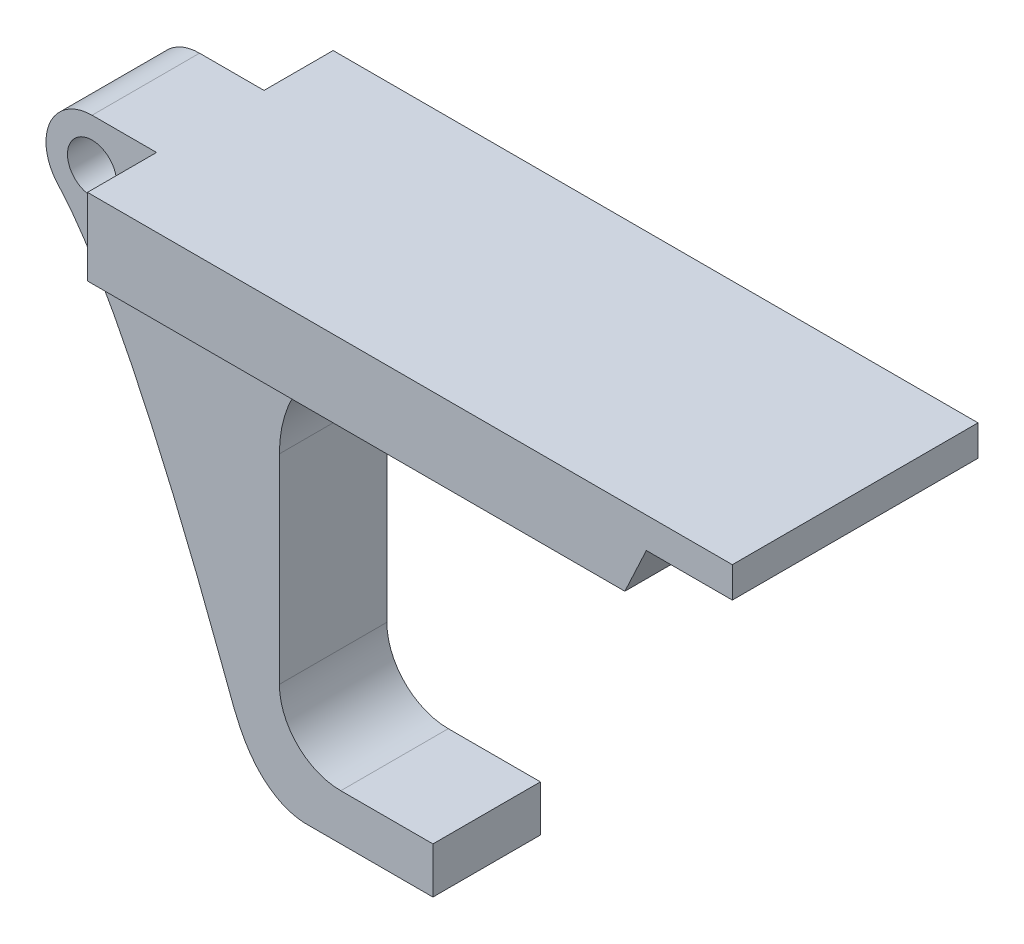
ISO-10303-21;
HEADER;
FILE_DESCRIPTION(('STEP AP214'),'2;1');
FILE_NAME('part.step','',(''),(''),'','','');
FILE_SCHEMA(('AUTOMOTIVE_DESIGN { 1 0 10303 214 1 1 1 1 }'));
ENDSEC;
DATA;
#1=APPLICATION_CONTEXT('core data for automotive mechanical design processes');
#2=APPLICATION_PROTOCOL_DEFINITION('international standard','automotive_design',2000,#1);
#3=PRODUCT_CONTEXT('',#1,'mechanical');
#4=PRODUCT('Part','Part','',(#3));
#5=PRODUCT_RELATED_PRODUCT_CATEGORY('part','',(#4));
#6=PRODUCT_DEFINITION_FORMATION('','',#4);
#7=PRODUCT_DEFINITION_CONTEXT('part definition',#1,'design');
#8=PRODUCT_DEFINITION('design','',#6,#7);
#9=PRODUCT_DEFINITION_SHAPE('','',#8);
#10=(LENGTH_UNIT() NAMED_UNIT(*) SI_UNIT(.MILLI.,.METRE.));
#11=(NAMED_UNIT(*) PLANE_ANGLE_UNIT() SI_UNIT($,.RADIAN.));
#12=(NAMED_UNIT(*) SI_UNIT($,.STERADIAN.) SOLID_ANGLE_UNIT());
#13=UNCERTAINTY_MEASURE_WITH_UNIT(LENGTH_MEASURE(1.E-05),#10,'distance_accuracy_value','');
#14=(GEOMETRIC_REPRESENTATION_CONTEXT(3) GLOBAL_UNCERTAINTY_ASSIGNED_CONTEXT((#13)) GLOBAL_UNIT_ASSIGNED_CONTEXT((#10,
#11,#12)) REPRESENTATION_CONTEXT('',''));
#15=CARTESIAN_POINT('',(0.,0.,0.));
#16=DIRECTION('',(0.,0.,1.));
#17=DIRECTION('',(1.,0.,0.));
#18=AXIS2_PLACEMENT_3D('',#15,#16,#17);
#19=CARTESIAN_POINT('',(21.,5.,8.));
#20=DIRECTION('',(-1.,0.,0.));
#21=DIRECTION('',(0.,0.,1.));
#22=AXIS2_PLACEMENT_3D('',#19,#20,#21);
#23=PLANE('',#22);
#24=DIRECTION('',(0.,0.,1.));
#25=VECTOR('',#24,1.);
#26=CARTESIAN_POINT('',(21.,3.,8.));
#27=LINE('',#26,#25);
#28=CARTESIAN_POINT('',(21.,3.,-8.));
#29=VERTEX_POINT('',#28);
#30=CARTESIAN_POINT('',(21.,3.,8.));
#31=VERTEX_POINT('',#30);
#32=EDGE_CURVE('E183',#29,#31,#27,.T.);
#33=ORIENTED_EDGE('',*,*,#32,.F.);
#34=DIRECTION('',(0.,-1.,0.));
#35=VECTOR('',#34,1.);
#36=CARTESIAN_POINT('',(21.,5.,-8.));
#37=LINE('',#36,#35);
#38=CARTESIAN_POINT('',(21.,5.,-8.));
#39=VERTEX_POINT('',#38);
#40=EDGE_CURVE('E195',#39,#29,#37,.T.);
#41=ORIENTED_EDGE('',*,*,#40,.F.);
#42=DIRECTION('',(0.,0.,-1.));
#43=VECTOR('',#42,1.);
#44=CARTESIAN_POINT('',(21.,5.,8.));
#45=LINE('',#44,#43);
#46=CARTESIAN_POINT('',(21.,5.,8.));
#47=VERTEX_POINT('',#46);
#48=EDGE_CURVE('E345',#47,#39,#45,.T.);
#49=ORIENTED_EDGE('',*,*,#48,.F.);
#50=DIRECTION('',(0.,-1.,0.));
#51=VECTOR('',#50,1.);
#52=CARTESIAN_POINT('',(21.,5.,8.));
#53=LINE('',#52,#51);
#54=EDGE_CURVE('E198',#47,#31,#53,.T.);
#55=ORIENTED_EDGE('',*,*,#54,.T.);
#56=EDGE_LOOP('',(#33,#41,#49,#55));
#57=FACE_BOUND('',#56,.T.);
#58=ADVANCED_FACE('F35',(#57),#23,.F.);
#59=CARTESIAN_POINT('',(0.,0.,0.));
#60=DIRECTION('',(0.,-1.,0.));
#61=DIRECTION('',(0.,0.,-1.));
#62=AXIS2_PLACEMENT_3D('',#59,#60,#61);
#63=PLANE('',#62);
#64=DIRECTION('',(0.,0.,-1.));
#65=VECTOR('',#64,1.);
#66=CARTESIAN_POINT('',(-5.,0.,-6.5));
#67=LINE('',#66,#65);
#68=CARTESIAN_POINT('',(-5.,0.,6.5));
#69=VERTEX_POINT('',#68);
#70=CARTESIAN_POINT('',(-5.,0.,-6.5));
#71=VERTEX_POINT('',#70);
#72=EDGE_CURVE('E249',#69,#71,#67,.T.);
#73=ORIENTED_EDGE('',*,*,#72,.T.);
#74=DIRECTION('',(1.,0.,0.));
#75=VECTOR('',#74,1.);
#76=CARTESIAN_POINT('',(0.,0.,-6.5));
#77=LINE('',#76,#75);
#78=CARTESIAN_POINT('',(-21.,0.,-6.5));
#79=VERTEX_POINT('',#78);
#80=EDGE_CURVE('E234',#71,#79,#77,.F.);
#81=ORIENTED_EDGE('',*,*,#80,.T.);
#82=DIRECTION('',(0.,0.,1.));
#83=VECTOR('',#82,1.);
#84=CARTESIAN_POINT('',(-21.,0.,-3.5));
#85=LINE('',#84,#83);
#86=CARTESIAN_POINT('',(-21.,0.,-8.));
#87=VERTEX_POINT('',#86);
#88=EDGE_CURVE('E333',#87,#79,#85,.T.);
#89=ORIENTED_EDGE('',*,*,#88,.F.);
#90=DIRECTION('',(-1.,0.,0.));
#91=VECTOR('',#90,1.);
#92=CARTESIAN_POINT('',(-21.,0.,-8.));
#93=LINE('',#92,#91);
#94=CARTESIAN_POINT('',(14.,0.,-8.));
#95=VERTEX_POINT('',#94);
#96=EDGE_CURVE('E338',#95,#87,#93,.T.);
#97=ORIENTED_EDGE('',*,*,#96,.F.);
#98=DIRECTION('',(0.,0.,-1.));
#99=VECTOR('',#98,1.);
#100=CARTESIAN_POINT('',(14.,0.,8.));
#101=LINE('',#100,#99);
#102=CARTESIAN_POINT('',(14.,0.,8.));
#103=VERTEX_POINT('',#102);
#104=EDGE_CURVE('E189',#103,#95,#101,.T.);
#105=ORIENTED_EDGE('',*,*,#104,.F.);
#106=DIRECTION('',(1.,0.,0.));
#107=VECTOR('',#106,1.);
#108=CARTESIAN_POINT('',(-21.,0.,8.));
#109=LINE('',#108,#107);
#110=CARTESIAN_POINT('',(-21.,0.,8.));
#111=VERTEX_POINT('',#110);
#112=EDGE_CURVE('E355',#111,#103,#109,.T.);
#113=ORIENTED_EDGE('',*,*,#112,.F.);
#114=DIRECTION('',(0.,0.,1.));
#115=VECTOR('',#114,1.);
#116=CARTESIAN_POINT('',(-21.,0.,8.));
#117=LINE('',#116,#115);
#118=CARTESIAN_POINT('',(-21.,0.,6.5));
#119=VERTEX_POINT('',#118);
#120=EDGE_CURVE('E353',#119,#111,#117,.T.);
#121=ORIENTED_EDGE('',*,*,#120,.F.);
#122=DIRECTION('',(-1.,0.,0.));
#123=VECTOR('',#122,1.);
#124=CARTESIAN_POINT('',(0.,0.,6.5));
#125=LINE('',#124,#123);
#126=EDGE_CURVE('E236',#119,#69,#125,.F.);
#127=ORIENTED_EDGE('',*,*,#126,.T.);
#128=EDGE_LOOP('',(#73,#81,#89,#97,#105,#113,#121,#127));
#129=FACE_BOUND('',#128,.T.);
#130=ADVANCED_FACE('F280',(#129),#63,.T.);
#131=CARTESIAN_POINT('',(-21.,5.,3.5));
#132=DIRECTION('',(0.,0.,-1.));
#133=DIRECTION('',(-1.,0.,0.));
#134=AXIS2_PLACEMENT_3D('',#131,#132,#133);
#135=PLANE('',#134);
#136=CARTESIAN_POINT('',(-25.2,2.,3.5));
#137=DIRECTION('',(0.,0.,-1.));
#138=DIRECTION('',(-1.,0.,0.));
#139=AXIS2_PLACEMENT_3D('',#136,#137,#138);
#140=CIRCLE('',#139,1.6);
#141=CARTESIAN_POINT('',(-26.8,2.,3.5));
#142=VERTEX_POINT('',#141);
#143=EDGE_CURVE('E341',#142,#142,#140,.F.);
#144=ORIENTED_EDGE('',*,*,#143,.F.);
#145=EDGE_LOOP('',(#144));
#146=FACE_BOUND('',#145,.T.);
#147=DIRECTION('',(0.,1.,0.));
#148=VECTOR('',#147,1.);
#149=CARTESIAN_POINT('',(-13.,-21.,3.5));
#150=LINE('',#149,#148);
#151=CARTESIAN_POINT('',(-13.,-21.,3.5));
#152=VERTEX_POINT('',#151);
#153=CARTESIAN_POINT('',(-13.,-8.,3.5));
#154=VERTEX_POINT('',#153);
#155=EDGE_CURVE('E375',#152,#154,#150,.T.);
#156=ORIENTED_EDGE('',*,*,#155,.T.);
#157=CARTESIAN_POINT('',(-5.,-8.,3.5));
#158=DIRECTION('',(0.,0.,-1.));
#159=DIRECTION('',(-1.,0.,0.));
#160=AXIS2_PLACEMENT_3D('',#157,#158,#159);
#161=CIRCLE('',#160,8.);
#162=CARTESIAN_POINT('',(-11.2449979983984,-3.,3.5));
#163=VERTEX_POINT('',#162);
#164=EDGE_CURVE('E49',#154,#163,#161,.T.);
#165=ORIENTED_EDGE('',*,*,#164,.T.);
#166=DIRECTION('',(-1.,0.,0.));
#167=VECTOR('',#166,1.);
#168=CARTESIAN_POINT('',(-21.,-3.,3.5));
#169=LINE('',#168,#167);
#170=CARTESIAN_POINT('',(-21.,-3.,3.5));
#171=VERTEX_POINT('',#170);
#172=EDGE_CURVE('E55',#163,#171,#169,.T.);
#173=ORIENTED_EDGE('',*,*,#172,.T.);
#174=DIRECTION('',(0.,-1.,0.));
#175=VECTOR('',#174,1.);
#176=CARTESIAN_POINT('',(-21.,5.,3.5));
#177=LINE('',#176,#175);
#178=CARTESIAN_POINT('',(-21.,5.,3.5));
#179=VERTEX_POINT('',#178);
#180=EDGE_CURVE('E215',#179,#171,#177,.T.);
#181=ORIENTED_EDGE('',*,*,#180,.F.);
#182=DIRECTION('',(1.,0.,0.));
#183=VECTOR('',#182,1.);
#184=CARTESIAN_POINT('',(-21.,5.,3.5));
#185=LINE('',#184,#183);
#186=CARTESIAN_POINT('',(-25.2,5.,3.5));
#187=VERTEX_POINT('',#186);
#188=EDGE_CURVE('E329',#187,#179,#185,.T.);
#189=ORIENTED_EDGE('',*,*,#188,.F.);
#190=CARTESIAN_POINT('',(-25.2,2.,3.5));
#191=DIRECTION('',(0.,0.,-1.));
#192=DIRECTION('',(-1.,0.,0.));
#193=AXIS2_PLACEMENT_3D('',#190,#191,#192);
#194=CIRCLE('',#193,3.);
#195=CARTESIAN_POINT('',(-28.2,2.,3.5));
#196=VERTEX_POINT('',#195);
#197=EDGE_CURVE('E221',#187,#196,#194,.F.);
#198=ORIENTED_EDGE('',*,*,#197,.T.);
#199=CARTESIAN_POINT('',(-25.2,2.,3.5));
#200=DIRECTION('',(0.,0.,-1.));
#201=DIRECTION('',(-1.,0.,0.));
#202=AXIS2_PLACEMENT_3D('',#199,#200,#201);
#203=CIRCLE('',#202,3.);
#204=CARTESIAN_POINT('',(-27.3917235049628,-0.0484989816432971,3.5));
#205=VERTEX_POINT('',#204);
#206=EDGE_CURVE('E223',#196,#205,#203,.F.);
#207=ORIENTED_EDGE('',*,*,#206,.T.);
#208=CARTESIAN_POINT('',(-10.9537756116111,-28.,3.50000000000001));
#209=CARTESIAN_POINT('',(-12.5004777600743,-28.0890401290219,3.50000000000001));
#210=CARTESIAN_POINT('',(-14.852115266093,-26.9193708974021,3.50000000000001));
#211=CARTESIAN_POINT('',(-18.6755897436882,-16.3650510589466,3.50000000000001));
#212=CARTESIAN_POINT('',(-23.8251647596441,-3.86442015319045,3.50000000000001));
#213=CARTESIAN_POINT('',(-27.3917235049628,-0.0484989816432775,3.50000000000001));
#214=B_SPLINE_CURVE_WITH_KNOTS('',3,(#208,#209,#210,#211,#212,#213),.UNSPECIFIED.,.F.,.F.,(4,1,
1,4),(0.,0.247683180444079,0.347683180444079,1.),.UNSPECIFIED.);
#215=CARTESIAN_POINT('',(-10.9537756116111,-28.,3.5));
#216=VERTEX_POINT('',#215);
#217=EDGE_CURVE('E232',#205,#216,#214,.F.);
#218=ORIENTED_EDGE('',*,*,#217,.T.);
#219=DIRECTION('',(1.,0.,0.));
#220=VECTOR('',#219,1.);
#221=CARTESIAN_POINT('',(-3.,-28.,3.5));
#222=LINE('',#221,#220);
#223=CARTESIAN_POINT('',(-3.,-28.,3.5));
#224=VERTEX_POINT('',#223);
#225=EDGE_CURVE('E394',#216,#224,#222,.T.);
#226=ORIENTED_EDGE('',*,*,#225,.T.);
#227=DIRECTION('',(0.,1.,0.));
#228=VECTOR('',#227,1.);
#229=CARTESIAN_POINT('',(-3.,-28.,3.5));
#230=LINE('',#229,#228);
#231=CARTESIAN_POINT('',(-3.,-25.,3.5));
#232=VERTEX_POINT('',#231);
#233=EDGE_CURVE('E392',#224,#232,#230,.T.);
#234=ORIENTED_EDGE('',*,*,#233,.T.);
#235=DIRECTION('',(-1.,0.,0.));
#236=VECTOR('',#235,1.);
#237=CARTESIAN_POINT('',(-3.,-25.,3.5));
#238=LINE('',#237,#236);
#239=CARTESIAN_POINT('',(-9.,-25.,3.5));
#240=VERTEX_POINT('',#239);
#241=EDGE_CURVE('E390',#232,#240,#238,.T.);
#242=ORIENTED_EDGE('',*,*,#241,.T.);
#243=CARTESIAN_POINT('',(-9.,-21.,3.5));
#244=DIRECTION('',(0.,0.,-1.));
#245=DIRECTION('',(-1.,0.,0.));
#246=AXIS2_PLACEMENT_3D('',#243,#244,#245);
#247=CIRCLE('',#246,4.);
#248=EDGE_CURVE('E387',#240,#152,#247,.T.);
#249=ORIENTED_EDGE('',*,*,#248,.T.);
#250=EDGE_LOOP('',(#156,#165,#173,#181,#189,#198,#207,#218,#226,#234,#242,#249));
#251=FACE_BOUND('',#250,.T.);
#252=ADVANCED_FACE('F285',(#146,#251),#135,.F.);
#253=CARTESIAN_POINT('',(-21.,5.,8.));
#254=DIRECTION('',(1.,0.,0.));
#255=DIRECTION('',(0.,0.,-1.));
#256=AXIS2_PLACEMENT_3D('',#253,#254,#255);
#257=PLANE('',#256);
#258=ORIENTED_EDGE('',*,*,#180,.T.);
#259=CARTESIAN_POINT('',(-21.,-3.,6.5));
#260=DIRECTION('',(1.,0.,0.));
#261=DIRECTION('',(0.,0.,-1.));
#262=AXIS2_PLACEMENT_3D('',#259,#260,#261);
#263=CIRCLE('',#262,3.);
#264=EDGE_CURVE('E239',#171,#119,#263,.T.);
#265=ORIENTED_EDGE('',*,*,#264,.T.);
#266=ORIENTED_EDGE('',*,*,#120,.T.);
#267=DIRECTION('',(0.,-1.,0.));
#268=VECTOR('',#267,1.);
#269=CARTESIAN_POINT('',(-21.,5.,8.));
#270=LINE('',#269,#268);
#271=CARTESIAN_POINT('',(-21.,5.,8.));
#272=VERTEX_POINT('',#271);
#273=EDGE_CURVE('E206',#272,#111,#270,.T.);
#274=ORIENTED_EDGE('',*,*,#273,.F.);
#275=DIRECTION('',(0.,0.,1.));
#276=VECTOR('',#275,1.);
#277=CARTESIAN_POINT('',(-21.,5.,8.));
#278=LINE('',#277,#276);
#279=EDGE_CURVE('E332',#179,#272,#278,.T.);
#280=ORIENTED_EDGE('',*,*,#279,.F.);
#281=EDGE_LOOP('',(#258,#265,#266,#274,#280));
#282=FACE_BOUND('',#281,.T.);
#283=ADVANCED_FACE('F294',(#282),#257,.F.);
#284=CARTESIAN_POINT('',(-21.,5.,8.));
#285=DIRECTION('',(0.,0.,-1.));
#286=DIRECTION('',(-1.,0.,0.));
#287=AXIS2_PLACEMENT_3D('',#284,#285,#286);
#288=PLANE('',#287);
#289=ORIENTED_EDGE('',*,*,#112,.T.);
#290=DIRECTION('',(0.422618261740704,0.906307787036648,0.));
#291=VECTOR('',#290,1.);
#292=CARTESIAN_POINT('',(9.66389427731176,-9.29880873036589,8.));
#293=LINE('',#292,#291);
#294=CARTESIAN_POINT('',(15.398922974465,3.,8.));
#295=VERTEX_POINT('',#294);
#296=EDGE_CURVE('E247',#103,#295,#293,.T.);
#297=ORIENTED_EDGE('',*,*,#296,.T.);
#298=DIRECTION('',(-1.,0.,0.));
#299=VECTOR('',#298,1.);
#300=CARTESIAN_POINT('',(14.,3.,8.));
#301=LINE('',#300,#299);
#302=EDGE_CURVE('E199',#31,#295,#301,.T.);
#303=ORIENTED_EDGE('',*,*,#302,.F.);
#304=ORIENTED_EDGE('',*,*,#54,.F.);
#305=DIRECTION('',(1.,0.,0.));
#306=VECTOR('',#305,1.);
#307=CARTESIAN_POINT('',(-21.,5.,8.));
#308=LINE('',#307,#306);
#309=EDGE_CURVE('E335',#272,#47,#308,.T.);
#310=ORIENTED_EDGE('',*,*,#309,.F.);
#311=ORIENTED_EDGE('',*,*,#273,.T.);
#312=EDGE_LOOP('',(#289,#297,#303,#304,#310,#311));
#313=FACE_BOUND('',#312,.T.);
#314=ADVANCED_FACE('F291',(#313),#288,.F.);
#315=CARTESIAN_POINT('',(-21.,5.,-8.));
#316=DIRECTION('',(0.,0.,1.));
#317=DIRECTION('',(1.,0.,0.));
#318=AXIS2_PLACEMENT_3D('',#315,#316,#317);
#319=PLANE('',#318);
#320=DIRECTION('',(1.,0.,0.));
#321=VECTOR('',#320,1.);
#322=CARTESIAN_POINT('',(14.,3.,-8.));
#323=LINE('',#322,#321);
#324=CARTESIAN_POINT('',(15.398922974465,3.,-8.));
#325=VERTEX_POINT('',#324);
#326=EDGE_CURVE('E179',#325,#29,#323,.T.);
#327=ORIENTED_EDGE('',*,*,#326,.F.);
#328=DIRECTION('',(-0.422618261740704,-0.906307787036648,0.));
#329=VECTOR('',#328,1.);
#330=CARTESIAN_POINT('',(9.66389427731176,-9.29880873036589,-8.));
#331=LINE('',#330,#329);
#332=EDGE_CURVE('E245',#325,#95,#331,.T.);
#333=ORIENTED_EDGE('',*,*,#332,.T.);
#334=ORIENTED_EDGE('',*,*,#96,.T.);
#335=DIRECTION('',(0.,-1.,0.));
#336=VECTOR('',#335,1.);
#337=CARTESIAN_POINT('',(-21.,5.,-8.));
#338=LINE('',#337,#336);
#339=CARTESIAN_POINT('',(-21.,5.,-8.));
#340=VERTEX_POINT('',#339);
#341=EDGE_CURVE('E204',#340,#87,#338,.T.);
#342=ORIENTED_EDGE('',*,*,#341,.F.);
#343=DIRECTION('',(-1.,0.,0.));
#344=VECTOR('',#343,1.);
#345=CARTESIAN_POINT('',(-21.,5.,-8.));
#346=LINE('',#345,#344);
#347=EDGE_CURVE('E203',#39,#340,#346,.T.);
#348=ORIENTED_EDGE('',*,*,#347,.F.);
#349=ORIENTED_EDGE('',*,*,#40,.T.);
#350=EDGE_LOOP('',(#327,#333,#334,#342,#348,#349));
#351=FACE_BOUND('',#350,.T.);
#352=ADVANCED_FACE('F201',(#351),#319,.F.);
#353=CARTESIAN_POINT('',(-21.,5.,-3.5));
#354=DIRECTION('',(1.,0.,0.));
#355=DIRECTION('',(0.,0.,-1.));
#356=AXIS2_PLACEMENT_3D('',#353,#354,#355);
#357=PLANE('',#356);
#358=ORIENTED_EDGE('',*,*,#88,.T.);
#359=CARTESIAN_POINT('',(-21.,-3.,-6.5));
#360=DIRECTION('',(1.,0.,0.));
#361=DIRECTION('',(0.,0.,-1.));
#362=AXIS2_PLACEMENT_3D('',#359,#360,#361);
#363=CIRCLE('',#362,3.);
#364=CARTESIAN_POINT('',(-21.,-3.,-3.5));
#365=VERTEX_POINT('',#364);
#366=EDGE_CURVE('E241',#79,#365,#363,.T.);
#367=ORIENTED_EDGE('',*,*,#366,.T.);
#368=DIRECTION('',(0.,-1.,0.));
#369=VECTOR('',#368,1.);
#370=CARTESIAN_POINT('',(-21.,5.,-3.5));
#371=LINE('',#370,#369);
#372=CARTESIAN_POINT('',(-21.,5.,-3.5));
#373=VERTEX_POINT('',#372);
#374=EDGE_CURVE('E209',#373,#365,#371,.T.);
#375=ORIENTED_EDGE('',*,*,#374,.F.);
#376=DIRECTION('',(0.,0.,1.));
#377=VECTOR('',#376,1.);
#378=CARTESIAN_POINT('',(-21.,5.,-3.5));
#379=LINE('',#378,#377);
#380=EDGE_CURVE('E348',#340,#373,#379,.T.);
#381=ORIENTED_EDGE('',*,*,#380,.F.);
#382=ORIENTED_EDGE('',*,*,#341,.T.);
#383=EDGE_LOOP('',(#358,#367,#375,#381,#382));
#384=FACE_BOUND('',#383,.T.);
#385=ADVANCED_FACE('F365',(#384),#357,.F.);
#386=CARTESIAN_POINT('',(-21.,5.,-3.5));
#387=DIRECTION('',(0.,0.,1.));
#388=DIRECTION('',(1.,0.,0.));
#389=AXIS2_PLACEMENT_3D('',#386,#387,#388);
#390=PLANE('',#389);
#391=ORIENTED_EDGE('',*,*,#374,.T.);
#392=DIRECTION('',(1.,0.,0.));
#393=VECTOR('',#392,1.);
#394=CARTESIAN_POINT('',(-21.,-3.,-3.5));
#395=LINE('',#394,#393);
#396=CARTESIAN_POINT('',(-11.2449979983984,-3.,-3.5));
#397=VERTEX_POINT('',#396);
#398=EDGE_CURVE('E63',#365,#397,#395,.T.);
#399=ORIENTED_EDGE('',*,*,#398,.T.);
#400=CARTESIAN_POINT('',(-5.,-8.,-3.5));
#401=DIRECTION('',(0.,0.,1.));
#402=DIRECTION('',(1.,0.,0.));
#403=AXIS2_PLACEMENT_3D('',#400,#401,#402);
#404=CIRCLE('',#403,8.);
#405=CARTESIAN_POINT('',(-13.,-8.,-3.5));
#406=VERTEX_POINT('',#405);
#407=EDGE_CURVE('E261',#397,#406,#404,.T.);
#408=ORIENTED_EDGE('',*,*,#407,.T.);
#409=DIRECTION('',(0.,-1.,0.));
#410=VECTOR('',#409,1.);
#411=CARTESIAN_POINT('',(-13.,-21.,-3.5));
#412=LINE('',#411,#410);
#413=CARTESIAN_POINT('',(-13.,-21.,-3.5));
#414=VERTEX_POINT('',#413);
#415=EDGE_CURVE('E618',#406,#414,#412,.T.);
#416=ORIENTED_EDGE('',*,*,#415,.T.);
#417=CARTESIAN_POINT('',(-9.,-21.,-3.5));
#418=DIRECTION('',(0.,0.,1.));
#419=DIRECTION('',(-1.,0.,0.));
#420=AXIS2_PLACEMENT_3D('',#417,#418,#419);
#421=CIRCLE('',#420,4.);
#422=CARTESIAN_POINT('',(-9.,-25.,-3.5));
#423=VERTEX_POINT('',#422);
#424=EDGE_CURVE('E614',#414,#423,#421,.T.);
#425=ORIENTED_EDGE('',*,*,#424,.T.);
#426=DIRECTION('',(1.,0.,0.));
#427=VECTOR('',#426,1.);
#428=CARTESIAN_POINT('',(-3.,-25.,-3.5));
#429=LINE('',#428,#427);
#430=CARTESIAN_POINT('',(-3.,-25.,-3.5));
#431=VERTEX_POINT('',#430);
#432=EDGE_CURVE('E611',#423,#431,#429,.T.);
#433=ORIENTED_EDGE('',*,*,#432,.T.);
#434=DIRECTION('',(0.,-1.,0.));
#435=VECTOR('',#434,1.);
#436=CARTESIAN_POINT('',(-3.,-28.,-3.5));
#437=LINE('',#436,#435);
#438=CARTESIAN_POINT('',(-3.,-28.,-3.5));
#439=VERTEX_POINT('',#438);
#440=EDGE_CURVE('E609',#431,#439,#437,.T.);
#441=ORIENTED_EDGE('',*,*,#440,.T.);
#442=DIRECTION('',(-1.,0.,0.));
#443=VECTOR('',#442,1.);
#444=CARTESIAN_POINT('',(-3.,-28.,-3.5));
#445=LINE('',#444,#443);
#446=CARTESIAN_POINT('',(-10.9537756116111,-28.,-3.5));
#447=VERTEX_POINT('',#446);
#448=EDGE_CURVE('E595',#439,#447,#445,.T.);
#449=ORIENTED_EDGE('',*,*,#448,.T.);
#450=CARTESIAN_POINT('',(-10.9537756116111,-28.,-3.5));
#451=CARTESIAN_POINT('',(-12.5004777600743,-28.0890401290219,-3.5));
#452=CARTESIAN_POINT('',(-14.852115266093,-26.9193708974021,-3.5));
#453=CARTESIAN_POINT('',(-18.6755897436882,-16.3650510589466,-3.5));
#454=CARTESIAN_POINT('',(-23.8251647596441,-3.86442015319045,-3.5));
#455=CARTESIAN_POINT('',(-27.3917235049628,-0.0484989816432775,-3.5));
#456=B_SPLINE_CURVE_WITH_KNOTS('',3,(#450,#451,#452,#453,#454,#455),.UNSPECIFIED.,.F.,.F.,(4,1,
1,4),(0.,0.247683180444079,0.347683180444079,1.),.UNSPECIFIED.);
#457=CARTESIAN_POINT('',(-27.3917235049628,-0.0484989816432974,-3.5));
#458=VERTEX_POINT('',#457);
#459=EDGE_CURVE('E406',#447,#458,#456,.T.);
#460=ORIENTED_EDGE('',*,*,#459,.T.);
#461=CARTESIAN_POINT('',(-25.2,2.,-3.5));
#462=DIRECTION('',(0.,0.,1.));
#463=DIRECTION('',(1.,0.,0.));
#464=AXIS2_PLACEMENT_3D('',#461,#462,#463);
#465=CIRCLE('',#464,3.);
#466=CARTESIAN_POINT('',(-28.2,2.,-3.5));
#467=VERTEX_POINT('',#466);
#468=EDGE_CURVE('E219',#458,#467,#465,.F.);
#469=ORIENTED_EDGE('',*,*,#468,.T.);
#470=CARTESIAN_POINT('',(-25.2,2.,-3.5));
#471=DIRECTION('',(0.,0.,1.));
#472=DIRECTION('',(1.,0.,0.));
#473=AXIS2_PLACEMENT_3D('',#470,#471,#472);
#474=CIRCLE('',#473,3.);
#475=CARTESIAN_POINT('',(-25.2,5.,-3.5));
#476=VERTEX_POINT('',#475);
#477=EDGE_CURVE('E217',#467,#476,#474,.F.);
#478=ORIENTED_EDGE('',*,*,#477,.T.);
#479=DIRECTION('',(-1.,0.,0.));
#480=VECTOR('',#479,1.);
#481=CARTESIAN_POINT('',(-21.,5.,-3.5));
#482=LINE('',#481,#480);
#483=EDGE_CURVE('E350',#373,#476,#482,.T.);
#484=ORIENTED_EDGE('',*,*,#483,.F.);
#485=EDGE_LOOP('',(#391,#399,#408,#416,#425,#433,#441,#449,#460,#469,#478,#484));
#486=FACE_BOUND('',#485,.T.);
#487=CARTESIAN_POINT('',(-25.2,2.,-3.5));
#488=DIRECTION('',(0.,0.,-1.));
#489=DIRECTION('',(-1.,0.,0.));
#490=AXIS2_PLACEMENT_3D('',#487,#488,#489);
#491=CIRCLE('',#490,1.6);
#492=CARTESIAN_POINT('',(-26.8,2.,-3.5));
#493=VERTEX_POINT('',#492);
#494=EDGE_CURVE('E231',#493,#493,#491,.T.);
#495=ORIENTED_EDGE('',*,*,#494,.F.);
#496=EDGE_LOOP('',(#495));
#497=FACE_BOUND('',#496,.T.);
#498=ADVANCED_FACE('F360',(#486,#497),#390,.F.);
#499=CARTESIAN_POINT('',(0.,5.,0.));
#500=DIRECTION('',(0.,-1.,0.));
#501=DIRECTION('',(0.,0.,-1.));
#502=AXIS2_PLACEMENT_3D('',#499,#500,#501);
#503=PLANE('',#502);
#504=ORIENTED_EDGE('',*,*,#483,.T.);
#505=DIRECTION('',(0.,0.,1.));
#506=VECTOR('',#505,1.);
#507=CARTESIAN_POINT('',(-25.2,5.,0.));
#508=LINE('',#507,#506);
#509=EDGE_CURVE('E226',#476,#187,#508,.T.);
#510=ORIENTED_EDGE('',*,*,#509,.T.);
#511=ORIENTED_EDGE('',*,*,#188,.T.);
#512=ORIENTED_EDGE('',*,*,#279,.T.);
#513=ORIENTED_EDGE('',*,*,#309,.T.);
#514=ORIENTED_EDGE('',*,*,#48,.T.);
#515=ORIENTED_EDGE('',*,*,#347,.T.);
#516=ORIENTED_EDGE('',*,*,#380,.T.);
#517=EDGE_LOOP('',(#504,#510,#511,#512,#513,#514,#515,#516));
#518=FACE_BOUND('',#517,.T.);
#519=ADVANCED_FACE('F313',(#518),#503,.F.);
#520=CARTESIAN_POINT('',(-25.2,2.,8.001));
#521=DIRECTION('',(0.,0.,-1.));
#522=DIRECTION('',(-1.,0.,0.));
#523=AXIS2_PLACEMENT_3D('',#520,#521,#522);
#524=CYLINDRICAL_SURFACE('',#523,1.6);
#525=ORIENTED_EDGE('',*,*,#494,.T.);
#526=EDGE_LOOP('',(#525));
#527=FACE_BOUND('',#526,.T.);
#528=ORIENTED_EDGE('',*,*,#143,.T.);
#529=EDGE_LOOP('',(#528));
#530=FACE_BOUND('',#529,.T.);
#531=ADVANCED_FACE('F308',(#527,#530),#524,.F.);
#532=CARTESIAN_POINT('',(-25.2,2.,0.));
#533=DIRECTION('',(0.,0.,1.));
#534=DIRECTION('',(1.,0.,0.));
#535=AXIS2_PLACEMENT_3D('',#532,#533,#534);
#536=CYLINDRICAL_SURFACE('',#535,3.);
#537=DIRECTION('',(0.,0.,1.));
#538=VECTOR('',#537,1.);
#539=CARTESIAN_POINT('',(-28.2,2.,3.5));
#540=LINE('',#539,#538);
#541=EDGE_CURVE('E228',#196,#467,#540,.F.);
#542=ORIENTED_EDGE('',*,*,#541,.F.);
#543=ORIENTED_EDGE('',*,*,#197,.F.);
#544=ORIENTED_EDGE('',*,*,#509,.F.);
#545=ORIENTED_EDGE('',*,*,#477,.F.);
#546=EDGE_LOOP('',(#542,#543,#544,#545));
#547=FACE_BOUND('',#546,.T.);
#548=ADVANCED_FACE('F305',(#547),#536,.T.);
#549=CARTESIAN_POINT('',(-25.2,2.,0.));
#550=DIRECTION('',(0.,0.,-1.));
#551=DIRECTION('',(-1.,0.,0.));
#552=AXIS2_PLACEMENT_3D('',#549,#550,#551);
#553=CYLINDRICAL_SURFACE('',#552,3.);
#554=DIRECTION('',(0.,0.,-1.));
#555=VECTOR('',#554,1.);
#556=CARTESIAN_POINT('',(-27.3917235049628,-0.0484989816432974,40.70148318162));
#557=LINE('',#556,#555);
#558=EDGE_CURVE('E323',#205,#458,#557,.T.);
#559=ORIENTED_EDGE('',*,*,#558,.F.);
#560=ORIENTED_EDGE('',*,*,#206,.F.);
#561=ORIENTED_EDGE('',*,*,#541,.T.);
#562=ORIENTED_EDGE('',*,*,#468,.F.);
#563=EDGE_LOOP('',(#559,#560,#561,#562));
#564=FACE_BOUND('',#563,.T.);
#565=ADVANCED_FACE('F302',(#564),#553,.T.);
#566=CARTESIAN_POINT('',(-10.9537756116111,-28.,40.70148318162));
#567=CARTESIAN_POINT('',(-12.5004777600743,-28.0890401290219,40.70148318162));
#568=CARTESIAN_POINT('',(-14.852115266093,-26.9193708974021,40.70148318162));
#569=CARTESIAN_POINT('',(-18.6755897436882,-16.3650510589466,40.70148318162));
#570=CARTESIAN_POINT('',(-23.8251647596441,-3.86442015319045,40.70148318162));
#571=CARTESIAN_POINT('',(-27.3917235049628,-0.0484989816432775,40.70148318162));
#572=B_SPLINE_CURVE_WITH_KNOTS('',3,(#566,#567,#568,#569,#570,#571),.UNSPECIFIED.,.F.,.F.,(4,1,
1,4),(0.,0.247683180444079,0.347683180444079,1.),.UNSPECIFIED.);
#573=DIRECTION('',(0.,0.,-1.));
#574=VECTOR('',#573,1.);
#575=SURFACE_OF_LINEAR_EXTRUSION('',#572,#574);
#576=ORIENTED_EDGE('',*,*,#217,.F.);
#577=ORIENTED_EDGE('',*,*,#558,.T.);
#578=ORIENTED_EDGE('',*,*,#459,.F.);
#579=DIRECTION('',(0.,0.,-1.));
#580=VECTOR('',#579,1.);
#581=CARTESIAN_POINT('',(-10.9537756116111,-28.,40.70148318162));
#582=LINE('',#581,#580);
#583=EDGE_CURVE('E388',#216,#447,#582,.T.);
#584=ORIENTED_EDGE('',*,*,#583,.F.);
#585=EDGE_LOOP('',(#576,#577,#578,#584));
#586=FACE_BOUND('',#585,.T.);
#587=ADVANCED_FACE('F304',(#586),#575,.T.);
#588=CARTESIAN_POINT('',(-3.,-28.,40.70148318162));
#589=DIRECTION('',(0.,-1.,0.));
#590=DIRECTION('',(0.,0.,-1.));
#591=AXIS2_PLACEMENT_3D('',#588,#589,#590);
#592=PLANE('',#591);
#593=ORIENTED_EDGE('',*,*,#225,.F.);
#594=ORIENTED_EDGE('',*,*,#583,.T.);
#595=ORIENTED_EDGE('',*,*,#448,.F.);
#596=DIRECTION('',(0.,0.,-1.));
#597=VECTOR('',#596,1.);
#598=CARTESIAN_POINT('',(-3.,-28.,40.70148318162));
#599=LINE('',#598,#597);
#600=EDGE_CURVE('E587',#224,#439,#599,.T.);
#601=ORIENTED_EDGE('',*,*,#600,.F.);
#602=EDGE_LOOP('',(#593,#594,#595,#601));
#603=FACE_BOUND('',#602,.T.);
#604=ADVANCED_FACE('F416',(#603),#592,.T.);
#605=CARTESIAN_POINT('',(-3.,-28.,40.70148318162));
#606=DIRECTION('',(1.,0.,0.));
#607=DIRECTION('',(0.,0.,-1.));
#608=AXIS2_PLACEMENT_3D('',#605,#606,#607);
#609=PLANE('',#608);
#610=ORIENTED_EDGE('',*,*,#233,.F.);
#611=ORIENTED_EDGE('',*,*,#600,.T.);
#612=ORIENTED_EDGE('',*,*,#440,.F.);
#613=DIRECTION('',(0.,0.,-1.));
#614=VECTOR('',#613,1.);
#615=CARTESIAN_POINT('',(-3.,-25.,40.70148318162));
#616=LINE('',#615,#614);
#617=EDGE_CURVE('E592',#232,#431,#616,.T.);
#618=ORIENTED_EDGE('',*,*,#617,.F.);
#619=EDGE_LOOP('',(#610,#611,#612,#618));
#620=FACE_BOUND('',#619,.T.);
#621=ADVANCED_FACE('F492',(#620),#609,.T.);
#622=CARTESIAN_POINT('',(-3.,-25.,40.70148318162));
#623=DIRECTION('',(0.,1.,0.));
#624=DIRECTION('',(0.,0.,1.));
#625=AXIS2_PLACEMENT_3D('',#622,#623,#624);
#626=PLANE('',#625);
#627=ORIENTED_EDGE('',*,*,#241,.F.);
#628=ORIENTED_EDGE('',*,*,#617,.T.);
#629=ORIENTED_EDGE('',*,*,#432,.F.);
#630=DIRECTION('',(0.,0.,-1.));
#631=VECTOR('',#630,1.);
#632=CARTESIAN_POINT('',(-9.,-25.,40.70148318162));
#633=LINE('',#632,#631);
#634=EDGE_CURVE('E599',#240,#423,#633,.T.);
#635=ORIENTED_EDGE('',*,*,#634,.F.);
#636=EDGE_LOOP('',(#627,#628,#629,#635));
#637=FACE_BOUND('',#636,.T.);
#638=ADVANCED_FACE('F485',(#637),#626,.T.);
#639=CARTESIAN_POINT('',(-9.,-21.,40.70148318162));
#640=DIRECTION('',(0.,0.,-1.));
#641=DIRECTION('',(-1.,0.,0.));
#642=AXIS2_PLACEMENT_3D('',#639,#640,#641);
#643=CYLINDRICAL_SURFACE('',#642,4.);
#644=ORIENTED_EDGE('',*,*,#248,.F.);
#645=ORIENTED_EDGE('',*,*,#634,.T.);
#646=ORIENTED_EDGE('',*,*,#424,.F.);
#647=DIRECTION('',(0.,0.,-1.));
#648=VECTOR('',#647,1.);
#649=CARTESIAN_POINT('',(-13.,-21.,40.70148318162));
#650=LINE('',#649,#648);
#651=EDGE_CURVE('E601',#152,#414,#650,.T.);
#652=ORIENTED_EDGE('',*,*,#651,.F.);
#653=EDGE_LOOP('',(#644,#645,#646,#652));
#654=FACE_BOUND('',#653,.T.);
#655=ADVANCED_FACE('F479',(#654),#643,.F.);
#656=CARTESIAN_POINT('',(-13.,-21.,40.70148318162));
#657=DIRECTION('',(1.,0.,0.));
#658=DIRECTION('',(0.,0.,-1.));
#659=AXIS2_PLACEMENT_3D('',#656,#657,#658);
#660=PLANE('',#659);
#661=ORIENTED_EDGE('',*,*,#415,.F.);
#662=DIRECTION('',(0.,0.,-1.));
#663=VECTOR('',#662,1.);
#664=CARTESIAN_POINT('',(-13.,-8.,6.5));
#665=LINE('',#664,#663);
#666=EDGE_CURVE('E252',#406,#154,#665,.F.);
#667=ORIENTED_EDGE('',*,*,#666,.T.);
#668=ORIENTED_EDGE('',*,*,#155,.F.);
#669=ORIENTED_EDGE('',*,*,#651,.T.);
#670=EDGE_LOOP('',(#661,#667,#668,#669));
#671=FACE_BOUND('',#670,.T.);
#672=ADVANCED_FACE('F418',(#671),#660,.T.);
#673=CARTESIAN_POINT('',(-21.,-3.,6.5));
#674=DIRECTION('',(-1.,0.,0.));
#675=DIRECTION('',(0.,0.,1.));
#676=AXIS2_PLACEMENT_3D('',#673,#674,#675);
#677=CYLINDRICAL_SURFACE('',#676,3.);
#678=ORIENTED_EDGE('',*,*,#172,.F.);
#679=CARTESIAN_POINT('',(-11.2449979983984,-3.,3.5));
#680=CARTESIAN_POINT('',(-11.1650601646542,-2.90012740893928,3.50001145933149));
#681=CARTESIAN_POINT('',(-11.0827530479754,-2.8022640493002,3.50498476350317));
#682=CARTESIAN_POINT('',(-10.9141261398109,-2.61119307546961,3.52375343970329));
#683=CARTESIAN_POINT('',(-10.8278127620165,-2.51797848376025,3.53753513323483));
#684=CARTESIAN_POINT('',(-10.6524096788208,-2.33731454737111,3.57267313833115));
#685=CARTESIAN_POINT('',(-10.5633504422508,-2.24982231231315,3.59396290665999));
#686=CARTESIAN_POINT('',(-10.3822052491334,-2.07992445088033,3.64320323057843));
#687=CARTESIAN_POINT('',(-10.2901176581715,-1.99752164269432,3.67115743558913));
#688=CARTESIAN_POINT('',(-10.056501236224,-1.79791897259753,3.74836183302904));
#689=CARTESIAN_POINT('',(-9.91335322782739,-1.68401001072873,3.80125900201093));
#690=CARTESIAN_POINT('',(-9.62248462974218,-1.46811871139787,3.91767773487555));
#691=CARTESIAN_POINT('',(-9.47476262682847,-1.36614010750731,3.98120260963528));
#692=CARTESIAN_POINT('',(-9.17484624819048,-1.17338934688599,4.11725232461433));
#693=CARTESIAN_POINT('',(-9.02263109739088,-1.08268474476538,4.18982664452794));
#694=CARTESIAN_POINT('',(-8.7153199917709,-0.912883351656053,4.34200537187818));
#695=CARTESIAN_POINT('',(-8.56022403653909,-0.833786562325168,4.42160978031884));
#696=CARTESIAN_POINT('',(-8.18245934200889,-0.656167851185848,4.62091357887565));
#697=CARTESIAN_POINT('',(-7.95861746603887,-0.563326242788706,4.74347524395011));
#698=CARTESIAN_POINT('',(-7.50759997033338,-0.399371240813408,4.99683407030184));
#699=CARTESIAN_POINT('',(-7.28042272528412,-0.328268835644938,5.12763535626877));
#700=CARTESIAN_POINT('',(-6.82434005398715,-0.207225909116098,5.39462728418327));
#701=CARTESIAN_POINT('',(-6.59543937753477,-0.157240341192547,5.53080576942982));
#702=CARTESIAN_POINT('',(-6.13636589276917,-0.0776957518770749,5.80665455907114));
#703=CARTESIAN_POINT('',(-5.90619386879365,-0.0481253051542993,5.94632286495871));
#704=CARTESIAN_POINT('',(-5.56572563598164,-0.0192643903144416,6.15388065355274));
#705=CARTESIAN_POINT('',(-5.45564370084913,-0.01222560693871,6.22113749708138));
#706=CARTESIAN_POINT('',(-5.23545664760462,-0.00270697645832896,6.35581638161125));
#707=CARTESIAN_POINT('',(-5.12535158017547,-0.000224481356884927,6.42323830384225));
#708=CARTESIAN_POINT('',(-5.01017024902662,-4.84889153057444E-06,6.49377202001175));
#709=CARTESIAN_POINT('',(-5.00508511244476,-4.94771440643226E-10,6.49688601749847));
#710=CARTESIAN_POINT('',(-5.,0.,6.5));
#711=B_SPLINE_CURVE_WITH_KNOTS('',3,(#679,#680,#681,#682,#683,#684,#685,#686,#687,#688,#689,
#690,#691,#692,#693,#694,#695,#696,#697,#698,#699,#700,#701,#702,#703,#704,#705,#706,#707,#708,
#709,#710),.UNSPECIFIED.,.F.,.F.,(4,2,2,2,2,2,2,2,2,2,2,2,2,2,2,4),(0.,0.383512110045577,
0.766430108588727,1.14603627767899,1.52585079711805,2.09627818364472,2.66688360895357,
3.24075829970258,3.81463307241232,4.62814045890814,5.44205836781326,6.25423114605848,
7.06594902221541,7.4534704109641,7.84076651091108,7.85865506064467),.UNSPECIFIED.);
#712=EDGE_CURVE('E11',#163,#69,#711,.T.);
#713=ORIENTED_EDGE('',*,*,#712,.T.);
#714=ORIENTED_EDGE('',*,*,#126,.F.);
#715=ORIENTED_EDGE('',*,*,#264,.F.);
#716=EDGE_LOOP('',(#678,#713,#714,#715));
#717=FACE_BOUND('',#716,.T.);
#718=ADVANCED_FACE('F265',(#717),#677,.F.);
#719=CARTESIAN_POINT('',(-21.,-3.,-6.5));
#720=DIRECTION('',(1.,0.,0.));
#721=DIRECTION('',(0.,0.,-1.));
#722=AXIS2_PLACEMENT_3D('',#719,#720,#721);
#723=CYLINDRICAL_SURFACE('',#722,3.);
#724=ORIENTED_EDGE('',*,*,#366,.F.);
#725=ORIENTED_EDGE('',*,*,#80,.F.);
#726=CARTESIAN_POINT('',(-11.2449979983984,-3.,-3.5));
#727=CARTESIAN_POINT('',(-11.1650601646542,-2.90012740893927,-3.50001145933149));
#728=CARTESIAN_POINT('',(-11.0827530479754,-2.8022640493002,-3.50498476350317));
#729=CARTESIAN_POINT('',(-10.9141261398109,-2.6111930754696,-3.52375343970329));
#730=CARTESIAN_POINT('',(-10.8278127620165,-2.51797848376023,-3.53753513323483));
#731=CARTESIAN_POINT('',(-10.6524096788208,-2.3373145473711,-3.57267313833116));
#732=CARTESIAN_POINT('',(-10.5633504422508,-2.24982231231314,-3.59396290665999));
#733=CARTESIAN_POINT('',(-10.3822052491334,-2.07992445088033,-3.64320323057843));
#734=CARTESIAN_POINT('',(-10.2901176581715,-1.99752164269431,-3.67115743558913));
#735=CARTESIAN_POINT('',(-10.056501236224,-1.79791897259754,-3.74836183302904));
#736=CARTESIAN_POINT('',(-9.91335322782739,-1.68401001072874,-3.80125900201093));
#737=CARTESIAN_POINT('',(-9.62248462974219,-1.46811871139787,-3.91767773487555));
#738=CARTESIAN_POINT('',(-9.47476262682848,-1.36614010750732,-3.98120260963527));
#739=CARTESIAN_POINT('',(-9.17484624819049,-1.173389346886,-4.11725232461433));
#740=CARTESIAN_POINT('',(-9.02263109739089,-1.08268474476538,-4.18982664452794));
#741=CARTESIAN_POINT('',(-8.71531999177091,-0.912883351656055,-4.34200537187818));
#742=CARTESIAN_POINT('',(-8.56022403653909,-0.833786562325169,-4.42160978031884));
#743=CARTESIAN_POINT('',(-8.18245934200888,-0.656167851185846,-4.62091357887566));
#744=CARTESIAN_POINT('',(-7.95861746603886,-0.563326242788703,-4.74347524395011));
#745=CARTESIAN_POINT('',(-7.50759997033337,-0.399371240813404,-4.99683407030185));
#746=CARTESIAN_POINT('',(-7.28042272528411,-0.328268835644934,-5.12763535626879));
#747=CARTESIAN_POINT('',(-6.82434005398713,-0.207225909116095,-5.39462728418327));
#748=CARTESIAN_POINT('',(-6.59543937753474,-0.157240341192544,-5.5308057694298));
#749=CARTESIAN_POINT('',(-6.13636589276918,-0.0776957518770731,-5.80665455907118));
#750=CARTESIAN_POINT('',(-5.90619386879371,-0.0481253051542988,-5.94632286495883));
#751=CARTESIAN_POINT('',(-5.5657256359816,-0.0192643903144427,-6.15388065355269));
#752=CARTESIAN_POINT('',(-5.45564370084903,-0.0122256069387116,-6.22113749708123));
#753=CARTESIAN_POINT('',(-5.23545664760469,-0.00270697645832892,-6.35581638161138));
#754=CARTESIAN_POINT('',(-5.12535158017578,-0.000224481356882685,-6.42323830384276));
#755=CARTESIAN_POINT('',(-5.01017024902665,-4.84889153036809E-06,-6.4937720200118));
#756=CARTESIAN_POINT('',(-5.00508511244478,-4.94771332969454E-10,-6.4968860174985));
#757=CARTESIAN_POINT('',(-5.,0.,-6.5));
#758=B_SPLINE_CURVE_WITH_KNOTS('',3,(#726,#727,#728,#729,#730,#731,#732,#733,#734,#735,#736,
#737,#738,#739,#740,#741,#742,#743,#744,#745,#746,#747,#748,#749,#750,#751,#752,#753,#754,#755,
#756,#757),.UNSPECIFIED.,.F.,.F.,(4,2,2,2,2,2,2,2,2,2,2,2,2,2,2,4),(0.,0.383512110045587,
0.766430108588748,1.146036277679,1.52585079711805,2.09627818364471,2.66688360895355,
3.24075829970257,3.81463307241232,4.62814045890815,5.44205836781328,6.25423114605849,
7.06594902221541,7.4534704109641,7.84076651091109,7.85865506064467),.UNSPECIFIED.);
#759=EDGE_CURVE('E254',#71,#397,#758,.F.);
#760=ORIENTED_EDGE('',*,*,#759,.T.);
#761=ORIENTED_EDGE('',*,*,#398,.F.);
#762=EDGE_LOOP('',(#724,#725,#760,#761));
#763=FACE_BOUND('',#762,.T.);
#764=ADVANCED_FACE('F262',(#763),#723,.F.);
#765=CARTESIAN_POINT('',(0.,3.,0.));
#766=DIRECTION('',(0.,-1.,0.));
#767=DIRECTION('',(0.,0.,-1.));
#768=AXIS2_PLACEMENT_3D('',#765,#766,#767);
#769=PLANE('',#768);
#770=ORIENTED_EDGE('',*,*,#302,.T.);
#771=DIRECTION('',(0.,0.,-1.));
#772=VECTOR('',#771,1.);
#773=CARTESIAN_POINT('',(15.398922974465,3.,0.));
#774=LINE('',#773,#772);
#775=EDGE_CURVE('E186',#295,#325,#774,.T.);
#776=ORIENTED_EDGE('',*,*,#775,.T.);
#777=ORIENTED_EDGE('',*,*,#326,.T.);
#778=ORIENTED_EDGE('',*,*,#32,.T.);
#779=EDGE_LOOP('',(#770,#776,#777,#778));
#780=FACE_BOUND('',#779,.T.);
#781=ADVANCED_FACE('F182',(#780),#769,.T.);
#782=CARTESIAN_POINT('',(15.398922974465,3.,0.));
#783=DIRECTION('',(-0.906307787036648,0.422618261740704,0.));
#784=DIRECTION('',(0.,0.,-1.));
#785=AXIS2_PLACEMENT_3D('',#782,#783,#784);
#786=PLANE('',#785);
#787=ORIENTED_EDGE('',*,*,#296,.F.);
#788=ORIENTED_EDGE('',*,*,#104,.T.);
#789=ORIENTED_EDGE('',*,*,#332,.F.);
#790=ORIENTED_EDGE('',*,*,#775,.F.);
#791=EDGE_LOOP('',(#787,#788,#789,#790));
#792=FACE_BOUND('',#791,.T.);
#793=ADVANCED_FACE('F269',(#792),#786,.F.);
#794=CARTESIAN_POINT('',(-5.,-8.,0.));
#795=DIRECTION('',(0.,0.,1.));
#796=DIRECTION('',(1.,0.,0.));
#797=AXIS2_PLACEMENT_3D('',#794,#795,#796);
#798=CYLINDRICAL_SURFACE('',#797,8.);
#799=ORIENTED_EDGE('',*,*,#164,.F.);
#800=ORIENTED_EDGE('',*,*,#666,.F.);
#801=ORIENTED_EDGE('',*,*,#407,.F.);
#802=ORIENTED_EDGE('',*,*,#759,.F.);
#803=ORIENTED_EDGE('',*,*,#72,.F.);
#804=ORIENTED_EDGE('',*,*,#712,.F.);
#805=EDGE_LOOP('',(#799,#800,#801,#802,#803,#804));
#806=FACE_BOUND('',#805,.T.);
#807=ADVANCED_FACE('F37',(#806),#798,.F.);
#808=CLOSED_SHELL('',(#58,#130,#252,#283,#314,#352,#385,#498,#519,#531,#548,#565,#587,#604,#621,
#638,#655,#672,#718,#764,#781,#793,#807));
#809=MANIFOLD_SOLID_BREP('B2',#808);
#810=ADVANCED_BREP_SHAPE_REPRESENTATION('',(#18,#809),#14);
#811=SHAPE_DEFINITION_REPRESENTATION(#9,#810);
ENDSEC;
END-ISO-10303-21;
